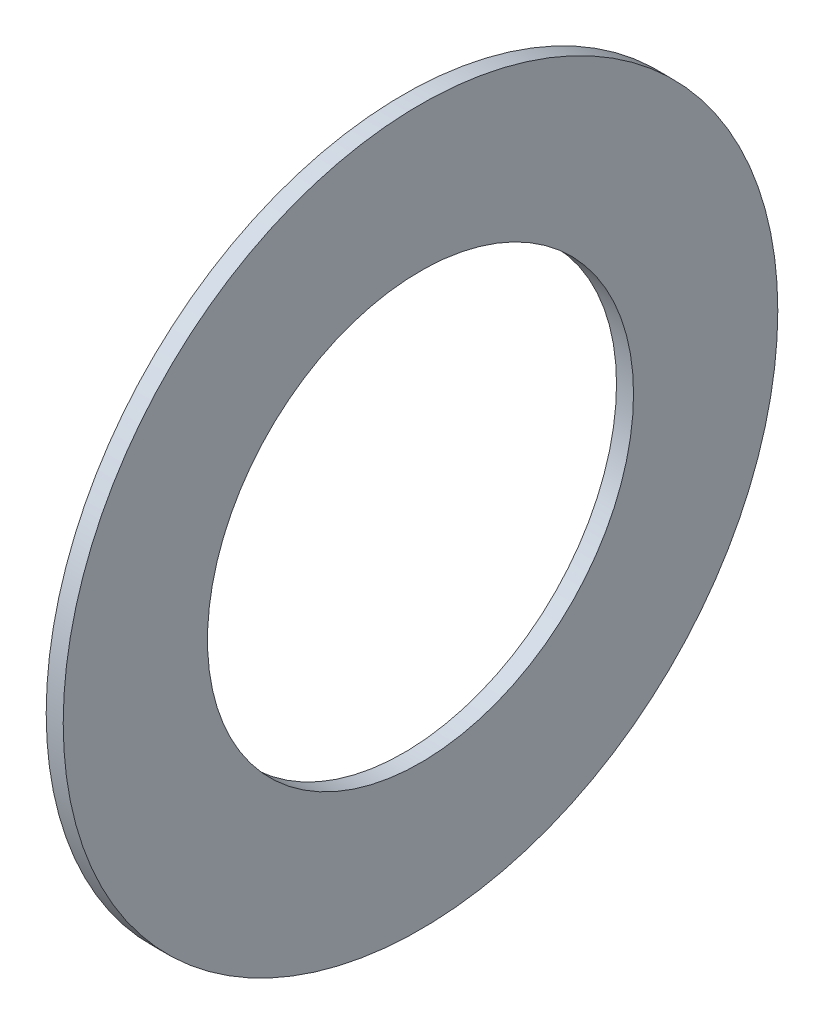
ISO-10303-21;
HEADER;
FILE_DESCRIPTION(('STEP AP214'),'2;1');
FILE_NAME('part.step','',(''),(''),'','','');
FILE_SCHEMA(('AUTOMOTIVE_DESIGN { 1 0 10303 214 1 1 1 1 }'));
ENDSEC;
DATA;
#1=APPLICATION_CONTEXT('core data for automotive mechanical design processes');
#2=APPLICATION_PROTOCOL_DEFINITION('international standard','automotive_design',2000,#1);
#3=PRODUCT_CONTEXT('',#1,'mechanical');
#4=PRODUCT('Part','Part','',(#3));
#5=PRODUCT_RELATED_PRODUCT_CATEGORY('part','',(#4));
#6=PRODUCT_DEFINITION_FORMATION('','',#4);
#7=PRODUCT_DEFINITION_CONTEXT('part definition',#1,'design');
#8=PRODUCT_DEFINITION('design','',#6,#7);
#9=PRODUCT_DEFINITION_SHAPE('','',#8);
#10=(LENGTH_UNIT() NAMED_UNIT(*) SI_UNIT(.MILLI.,.METRE.));
#11=(NAMED_UNIT(*) PLANE_ANGLE_UNIT() SI_UNIT($,.RADIAN.));
#12=(NAMED_UNIT(*) SI_UNIT($,.STERADIAN.) SOLID_ANGLE_UNIT());
#13=UNCERTAINTY_MEASURE_WITH_UNIT(LENGTH_MEASURE(1.E-05),#10,'distance_accuracy_value','');
#14=(GEOMETRIC_REPRESENTATION_CONTEXT(3) GLOBAL_UNCERTAINTY_ASSIGNED_CONTEXT((#13)) GLOBAL_UNIT_ASSIGNED_CONTEXT((#10,
#11,#12)) REPRESENTATION_CONTEXT('',''));
#15=CARTESIAN_POINT('',(0.,0.,0.));
#16=DIRECTION('',(0.,0.,1.));
#17=DIRECTION('',(1.,0.,0.));
#18=AXIS2_PLACEMENT_3D('',#15,#16,#17);
#19=CARTESIAN_POINT('',(0.499999999999975,0.,0.));
#20=DIRECTION('',(1.,0.,0.));
#21=DIRECTION('',(0.,0.,-1.));
#22=AXIS2_PLACEMENT_3D('',#19,#20,#21);
#23=PLANE('',#22);
#24=CARTESIAN_POINT('',(0.499999999999975,0.,0.));
#25=DIRECTION('',(1.,0.,0.));
#26=DIRECTION('',(0.,0.,-1.));
#27=AXIS2_PLACEMENT_3D('',#24,#25,#26);
#28=CIRCLE('',#27,21.);
#29=CARTESIAN_POINT('',(0.499999999999975,0.,-21.));
#30=VERTEX_POINT('',#29);
#31=EDGE_CURVE('E10',#30,#30,#28,.T.);
#32=ORIENTED_EDGE('',*,*,#31,.T.);
#33=EDGE_LOOP('',(#32));
#34=FACE_BOUND('',#33,.T.);
#35=CARTESIAN_POINT('',(0.499999999999975,0.,0.));
#36=DIRECTION('',(1.,0.,0.));
#37=DIRECTION('',(0.,0.,-1.));
#38=AXIS2_PLACEMENT_3D('',#35,#36,#37);
#39=CIRCLE('',#38,12.52);
#40=CARTESIAN_POINT('',(0.499999999999975,0.,-12.52));
#41=VERTEX_POINT('',#40);
#42=EDGE_CURVE('E42',#41,#41,#39,.T.);
#43=ORIENTED_EDGE('',*,*,#42,.F.);
#44=EDGE_LOOP('',(#43));
#45=FACE_BOUND('',#44,.T.);
#46=ADVANCED_FACE('F35',(#34,#45),#23,.T.);
#47=CARTESIAN_POINT('',(0.499999999999975,0.,0.));
#48=DIRECTION('',(-1.,0.,0.));
#49=DIRECTION('',(0.,0.,1.));
#50=AXIS2_PLACEMENT_3D('',#47,#48,#49);
#51=CYLINDRICAL_SURFACE('',#50,21.);
#52=ORIENTED_EDGE('',*,*,#31,.F.);
#53=EDGE_LOOP('',(#52));
#54=FACE_BOUND('',#53,.T.);
#55=CARTESIAN_POINT('',(-0.500000000000025,0.,0.));
#56=DIRECTION('',(1.,0.,0.));
#57=DIRECTION('',(0.,0.,-1.));
#58=AXIS2_PLACEMENT_3D('',#55,#56,#57);
#59=CIRCLE('',#58,21.);
#60=CARTESIAN_POINT('',(-0.500000000000025,0.,-21.));
#61=VERTEX_POINT('',#60);
#62=EDGE_CURVE('E46',#61,#61,#59,.T.);
#63=ORIENTED_EDGE('',*,*,#62,.T.);
#64=EDGE_LOOP('',(#63));
#65=FACE_BOUND('',#64,.T.);
#66=ADVANCED_FACE('F37',(#54,#65),#51,.T.);
#67=CARTESIAN_POINT('',(0.499999999999975,0.,0.));
#68=DIRECTION('',(-1.,0.,0.));
#69=DIRECTION('',(0.,0.,1.));
#70=AXIS2_PLACEMENT_3D('',#67,#68,#69);
#71=CYLINDRICAL_SURFACE('',#70,12.52);
#72=ORIENTED_EDGE('',*,*,#42,.T.);
#73=EDGE_LOOP('',(#72));
#74=FACE_BOUND('',#73,.T.);
#75=CARTESIAN_POINT('',(-0.500000000000025,0.,0.));
#76=DIRECTION('',(1.,0.,0.));
#77=DIRECTION('',(0.,0.,-1.));
#78=AXIS2_PLACEMENT_3D('',#75,#76,#77);
#79=CIRCLE('',#78,12.52);
#80=CARTESIAN_POINT('',(-0.500000000000025,0.,-12.52));
#81=VERTEX_POINT('',#80);
#82=EDGE_CURVE('E50',#81,#81,#79,.T.);
#83=ORIENTED_EDGE('',*,*,#82,.F.);
#84=EDGE_LOOP('',(#83));
#85=FACE_BOUND('',#84,.T.);
#86=ADVANCED_FACE('F59',(#74,#85),#71,.F.);
#87=CARTESIAN_POINT('',(-0.500000000000025,0.,0.));
#88=DIRECTION('',(1.,0.,0.));
#89=DIRECTION('',(0.,0.,-1.));
#90=AXIS2_PLACEMENT_3D('',#87,#88,#89);
#91=PLANE('',#90);
#92=ORIENTED_EDGE('',*,*,#82,.T.);
#93=EDGE_LOOP('',(#92));
#94=FACE_BOUND('',#93,.T.);
#95=ORIENTED_EDGE('',*,*,#62,.F.);
#96=EDGE_LOOP('',(#95));
#97=FACE_BOUND('',#96,.T.);
#98=ADVANCED_FACE('F56',(#94,#97),#91,.F.);
#99=CLOSED_SHELL('',(#46,#66,#86,#98));
#100=MANIFOLD_SOLID_BREP('B2',#99);
#101=ADVANCED_BREP_SHAPE_REPRESENTATION('',(#18,#100),#14);
#102=SHAPE_DEFINITION_REPRESENTATION(#9,#101);
ENDSEC;
END-ISO-10303-21;
